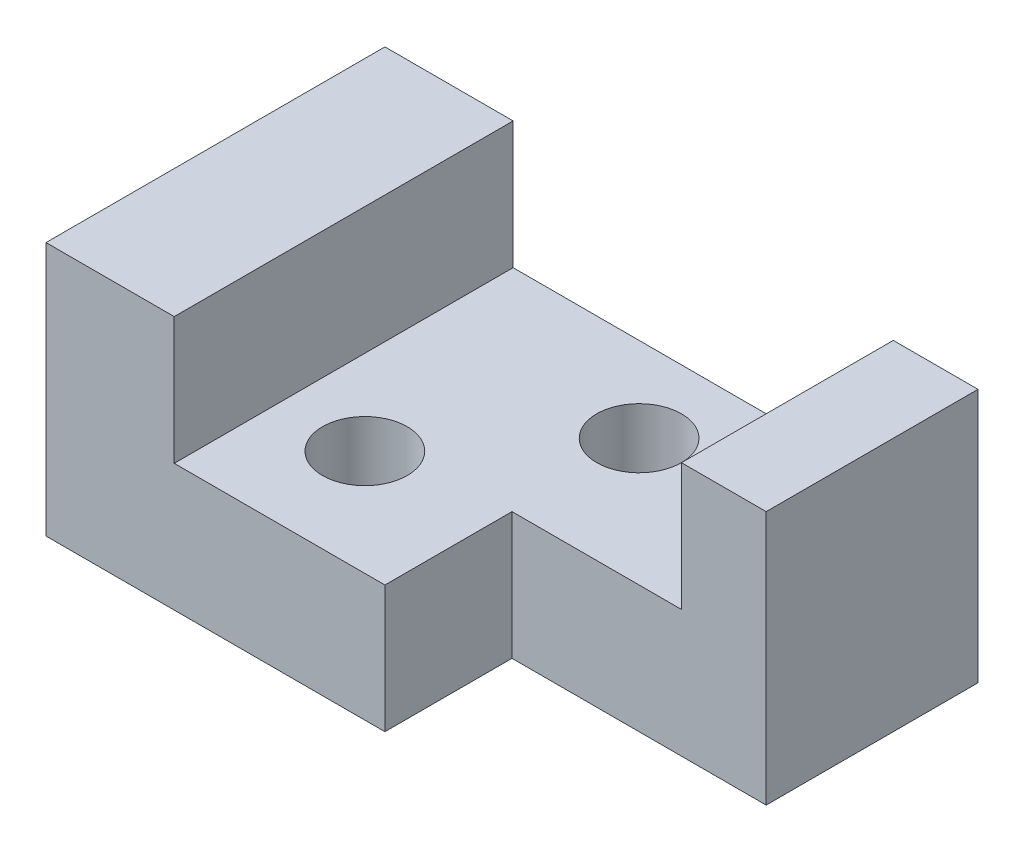
ISO-10303-21;
HEADER;
FILE_DESCRIPTION(('STEP AP214'),'2;1');
FILE_NAME('part.step','',(''),(''),'','','');
FILE_SCHEMA(('AUTOMOTIVE_DESIGN { 1 0 10303 214 1 1 1 1 }'));
ENDSEC;
DATA;
#1=APPLICATION_CONTEXT('core data for automotive mechanical design processes');
#2=APPLICATION_PROTOCOL_DEFINITION('international standard','automotive_design',2000,#1);
#3=PRODUCT_CONTEXT('',#1,'mechanical');
#4=PRODUCT('Part','Part','',(#3));
#5=PRODUCT_RELATED_PRODUCT_CATEGORY('part','',(#4));
#6=PRODUCT_DEFINITION_FORMATION('','',#4);
#7=PRODUCT_DEFINITION_CONTEXT('part definition',#1,'design');
#8=PRODUCT_DEFINITION('design','',#6,#7);
#9=PRODUCT_DEFINITION_SHAPE('','',#8);
#10=(LENGTH_UNIT() NAMED_UNIT(*) SI_UNIT(.MILLI.,.METRE.));
#11=(NAMED_UNIT(*) PLANE_ANGLE_UNIT() SI_UNIT($,.RADIAN.));
#12=(NAMED_UNIT(*) SI_UNIT($,.STERADIAN.) SOLID_ANGLE_UNIT());
#13=UNCERTAINTY_MEASURE_WITH_UNIT(LENGTH_MEASURE(1.E-05),#10,'distance_accuracy_value','');
#14=(GEOMETRIC_REPRESENTATION_CONTEXT(3) GLOBAL_UNCERTAINTY_ASSIGNED_CONTEXT((#13)) GLOBAL_UNIT_ASSIGNED_CONTEXT((#10,
#11,#12)) REPRESENTATION_CONTEXT('',''));
#15=CARTESIAN_POINT('',(0.,0.,0.));
#16=DIRECTION('',(0.,0.,1.));
#17=DIRECTION('',(1.,0.,0.));
#18=AXIS2_PLACEMENT_3D('',#15,#16,#17);
#19=CARTESIAN_POINT('',(0.,30.,0.));
#20=DIRECTION('',(0.,-1.,0.));
#21=DIRECTION('',(0.,0.,-1.));
#22=AXIS2_PLACEMENT_3D('',#19,#20,#21);
#23=PLANE('',#22);
#24=DIRECTION('',(-1.,0.,0.));
#25=VECTOR('',#24,1.);
#26=CARTESIAN_POINT('',(0.,30.,-40.));
#27=LINE('',#26,#25);
#28=CARTESIAN_POINT('',(70.,30.,-40.));
#29=VERTEX_POINT('',#28);
#30=CARTESIAN_POINT('',(60.,30.,-40.));
#31=VERTEX_POINT('',#30);
#32=EDGE_CURVE('E216',#29,#31,#27,.T.);
#33=ORIENTED_EDGE('',*,*,#32,.T.);
#34=DIRECTION('',(0.,0.,-1.));
#35=VECTOR('',#34,1.);
#36=CARTESIAN_POINT('',(60.,30.,-40.));
#37=LINE('',#36,#35);
#38=CARTESIAN_POINT('',(60.,30.,-15.));
#39=VERTEX_POINT('',#38);
#40=EDGE_CURVE('E137',#39,#31,#37,.T.);
#41=ORIENTED_EDGE('',*,*,#40,.F.);
#42=DIRECTION('',(-1.,0.,0.));
#43=VECTOR('',#42,1.);
#44=CARTESIAN_POINT('',(40.,30.,-15.));
#45=LINE('',#44,#43);
#46=CARTESIAN_POINT('',(70.,30.,-15.));
#47=VERTEX_POINT('',#46);
#48=EDGE_CURVE('E183',#47,#39,#45,.T.);
#49=ORIENTED_EDGE('',*,*,#48,.F.);
#50=DIRECTION('',(0.,0.,-1.));
#51=VECTOR('',#50,1.);
#52=CARTESIAN_POINT('',(70.,30.,0.));
#53=LINE('',#52,#51);
#54=EDGE_CURVE('E212',#47,#29,#53,.T.);
#55=ORIENTED_EDGE('',*,*,#54,.T.);
#56=EDGE_LOOP('',(#33,#41,#49,#55));
#57=FACE_BOUND('',#56,.T.);
#58=ADVANCED_FACE('F39',(#57),#23,.F.);
#59=CARTESIAN_POINT('',(0.,30.,0.));
#60=DIRECTION('',(1.,0.,0.));
#61=DIRECTION('',(0.,0.,-1.));
#62=AXIS2_PLACEMENT_3D('',#59,#60,#61);
#63=PLANE('',#62);
#64=DIRECTION('',(0.,0.,1.));
#65=VECTOR('',#64,1.);
#66=CARTESIAN_POINT('',(0.,0.,0.));
#67=LINE('',#66,#65);
#68=CARTESIAN_POINT('',(0.,0.,-40.));
#69=VERTEX_POINT('',#68);
#70=CARTESIAN_POINT('',(0.,0.,0.));
#71=VERTEX_POINT('',#70);
#72=EDGE_CURVE('E197',#69,#71,#67,.T.);
#73=ORIENTED_EDGE('',*,*,#72,.T.);
#74=DIRECTION('',(0.,-1.,0.));
#75=VECTOR('',#74,1.);
#76=CARTESIAN_POINT('',(0.,30.,0.));
#77=LINE('',#76,#75);
#78=CARTESIAN_POINT('',(0.,30.,0.));
#79=VERTEX_POINT('',#78);
#80=EDGE_CURVE('E48',#79,#71,#77,.T.);
#81=ORIENTED_EDGE('',*,*,#80,.F.);
#82=DIRECTION('',(0.,0.,1.));
#83=VECTOR('',#82,1.);
#84=CARTESIAN_POINT('',(0.,30.,0.));
#85=LINE('',#84,#83);
#86=CARTESIAN_POINT('',(0.,30.,-40.));
#87=VERTEX_POINT('',#86);
#88=EDGE_CURVE('E204',#87,#79,#85,.T.);
#89=ORIENTED_EDGE('',*,*,#88,.F.);
#90=DIRECTION('',(0.,-1.,0.));
#91=VECTOR('',#90,1.);
#92=CARTESIAN_POINT('',(0.,30.,-40.));
#93=LINE('',#92,#91);
#94=EDGE_CURVE('E219',#87,#69,#93,.T.);
#95=ORIENTED_EDGE('',*,*,#94,.T.);
#96=EDGE_LOOP('',(#73,#81,#89,#95));
#97=FACE_BOUND('',#96,.T.);
#98=ADVANCED_FACE('F41',(#97),#63,.F.);
#99=CARTESIAN_POINT('',(0.,30.,0.));
#100=DIRECTION('',(0.,0.,-1.));
#101=DIRECTION('',(-1.,0.,0.));
#102=AXIS2_PLACEMENT_3D('',#99,#100,#101);
#103=PLANE('',#102);
#104=ORIENTED_EDGE('',*,*,#80,.T.);
#105=DIRECTION('',(1.,0.,0.));
#106=VECTOR('',#105,1.);
#107=CARTESIAN_POINT('',(0.,0.,0.));
#108=LINE('',#107,#106);
#109=CARTESIAN_POINT('',(40.,0.,0.));
#110=VERTEX_POINT('',#109);
#111=EDGE_CURVE('E223',#71,#110,#108,.T.);
#112=ORIENTED_EDGE('',*,*,#111,.T.);
#113=DIRECTION('',(0.,1.,0.));
#114=VECTOR('',#113,1.);
#115=CARTESIAN_POINT('',(40.,0.,0.));
#116=LINE('',#115,#114);
#117=CARTESIAN_POINT('',(40.,15.,0.));
#118=VERTEX_POINT('',#117);
#119=EDGE_CURVE('E190',#110,#118,#116,.T.);
#120=ORIENTED_EDGE('',*,*,#119,.T.);
#121=DIRECTION('',(-1.,0.,0.));
#122=VECTOR('',#121,1.);
#123=CARTESIAN_POINT('',(56.8625684816038,15.,0.));
#124=LINE('',#123,#122);
#125=CARTESIAN_POINT('',(15.1339475960128,15.,0.));
#126=VERTEX_POINT('',#125);
#127=EDGE_CURVE('E129',#118,#126,#124,.T.);
#128=ORIENTED_EDGE('',*,*,#127,.T.);
#129=DIRECTION('',(0.,1.,0.));
#130=VECTOR('',#129,1.);
#131=CARTESIAN_POINT('',(15.1339475960128,15.,0.));
#132=LINE('',#131,#130);
#133=CARTESIAN_POINT('',(15.1339475960128,30.,0.));
#134=VERTEX_POINT('',#133);
#135=EDGE_CURVE('E169',#126,#134,#132,.T.);
#136=ORIENTED_EDGE('',*,*,#135,.T.);
#137=DIRECTION('',(1.,0.,0.));
#138=VECTOR('',#137,1.);
#139=CARTESIAN_POINT('',(0.,30.,0.));
#140=LINE('',#139,#138);
#141=EDGE_CURVE('E208',#79,#134,#140,.T.);
#142=ORIENTED_EDGE('',*,*,#141,.F.);
#143=EDGE_LOOP('',(#104,#112,#120,#128,#136,#142));
#144=FACE_BOUND('',#143,.T.);
#145=ADVANCED_FACE('F242',(#144),#103,.F.);
#146=CARTESIAN_POINT('',(70.,30.,0.));
#147=DIRECTION('',(-1.,0.,0.));
#148=DIRECTION('',(0.,0.,1.));
#149=AXIS2_PLACEMENT_3D('',#146,#147,#148);
#150=PLANE('',#149);
#151=ORIENTED_EDGE('',*,*,#54,.F.);
#152=DIRECTION('',(0.,1.,0.));
#153=VECTOR('',#152,1.);
#154=CARTESIAN_POINT('',(70.,0.,-15.));
#155=LINE('',#154,#153);
#156=CARTESIAN_POINT('',(70.,0.,-15.));
#157=VERTEX_POINT('',#156);
#158=EDGE_CURVE('E198',#157,#47,#155,.T.);
#159=ORIENTED_EDGE('',*,*,#158,.F.);
#160=DIRECTION('',(0.,0.,-1.));
#161=VECTOR('',#160,1.);
#162=CARTESIAN_POINT('',(70.,0.,0.));
#163=LINE('',#162,#161);
#164=CARTESIAN_POINT('',(70.,0.,-40.));
#165=VERTEX_POINT('',#164);
#166=EDGE_CURVE('E227',#157,#165,#163,.T.);
#167=ORIENTED_EDGE('',*,*,#166,.T.);
#168=DIRECTION('',(0.,-1.,0.));
#169=VECTOR('',#168,1.);
#170=CARTESIAN_POINT('',(70.,30.,-40.));
#171=LINE('',#170,#169);
#172=EDGE_CURVE('E235',#29,#165,#171,.T.);
#173=ORIENTED_EDGE('',*,*,#172,.F.);
#174=EDGE_LOOP('',(#151,#159,#167,#173));
#175=FACE_BOUND('',#174,.T.);
#176=ADVANCED_FACE('F255',(#175),#150,.F.);
#177=CARTESIAN_POINT('',(0.,30.,-40.));
#178=DIRECTION('',(0.,0.,1.));
#179=DIRECTION('',(1.,0.,0.));
#180=AXIS2_PLACEMENT_3D('',#177,#178,#179);
#181=PLANE('',#180);
#182=DIRECTION('',(-1.,0.,0.));
#183=VECTOR('',#182,1.);
#184=CARTESIAN_POINT('',(56.8625684816038,15.,-40.));
#185=LINE('',#184,#183);
#186=CARTESIAN_POINT('',(60.,15.,-40.));
#187=VERTEX_POINT('',#186);
#188=CARTESIAN_POINT('',(15.1339475960128,15.,-40.));
#189=VERTEX_POINT('',#188);
#190=EDGE_CURVE('E117',#187,#189,#185,.T.);
#191=ORIENTED_EDGE('',*,*,#190,.F.);
#192=DIRECTION('',(0.,1.,0.));
#193=VECTOR('',#192,1.);
#194=CARTESIAN_POINT('',(60.,15.,-40.));
#195=LINE('',#194,#193);
#196=EDGE_CURVE('E121',#187,#31,#195,.T.);
#197=ORIENTED_EDGE('',*,*,#196,.T.);
#198=ORIENTED_EDGE('',*,*,#32,.F.);
#199=ORIENTED_EDGE('',*,*,#172,.T.);
#200=DIRECTION('',(-1.,0.,0.));
#201=VECTOR('',#200,1.);
#202=CARTESIAN_POINT('',(0.,0.,-40.));
#203=LINE('',#202,#201);
#204=EDGE_CURVE('E209',#165,#69,#203,.T.);
#205=ORIENTED_EDGE('',*,*,#204,.T.);
#206=ORIENTED_EDGE('',*,*,#94,.F.);
#207=CARTESIAN_POINT('',(15.1339475960128,30.,-40.));
#208=VERTEX_POINT('',#207);
#209=EDGE_CURVE('E215',#208,#87,#27,.T.);
#210=ORIENTED_EDGE('',*,*,#209,.F.);
#211=DIRECTION('',(0.,1.,0.));
#212=VECTOR('',#211,1.);
#213=CARTESIAN_POINT('',(15.1339475960128,15.,-40.));
#214=LINE('',#213,#212);
#215=EDGE_CURVE('E124',#189,#208,#214,.T.);
#216=ORIENTED_EDGE('',*,*,#215,.F.);
#217=EDGE_LOOP('',(#191,#197,#198,#199,#205,#206,#210,#216));
#218=FACE_BOUND('',#217,.T.);
#219=ADVANCED_FACE('F119',(#218),#181,.F.);
#220=ORIENTED_EDGE('',*,*,#141,.T.);
#221=DIRECTION('',(0.,0.,-1.));
#222=VECTOR('',#221,1.);
#223=CARTESIAN_POINT('',(15.1339475960128,30.,0.));
#224=LINE('',#223,#222);
#225=EDGE_CURVE('E162',#134,#208,#224,.T.);
#226=ORIENTED_EDGE('',*,*,#225,.T.);
#227=ORIENTED_EDGE('',*,*,#209,.T.);
#228=ORIENTED_EDGE('',*,*,#88,.T.);
#229=EDGE_LOOP('',(#220,#226,#227,#228));
#230=FACE_BOUND('',#229,.T.);
#231=ADVANCED_FACE('F262',(#230),#23,.F.);
#232=CARTESIAN_POINT('',(0.,0.,0.));
#233=DIRECTION('',(0.,-1.,0.));
#234=DIRECTION('',(0.,0.,-1.));
#235=AXIS2_PLACEMENT_3D('',#232,#233,#234);
#236=PLANE('',#235);
#237=CARTESIAN_POINT('',(25.1339475960128,0.,-12.5));
#238=DIRECTION('',(0.,1.,0.));
#239=DIRECTION('',(0.,0.,1.));
#240=AXIS2_PLACEMENT_3D('',#237,#238,#239);
#241=CIRCLE('',#240,5.);
#242=CARTESIAN_POINT('',(25.1339475960128,0.,-7.5));
#243=VERTEX_POINT('',#242);
#244=EDGE_CURVE('E150',#243,#243,#241,.T.);
#245=ORIENTED_EDGE('',*,*,#244,.T.);
#246=EDGE_LOOP('',(#245));
#247=FACE_BOUND('',#246,.T.);
#248=CARTESIAN_POINT('',(40.,0.,-30.));
#249=DIRECTION('',(0.,1.,0.));
#250=DIRECTION('',(0.,0.,1.));
#251=AXIS2_PLACEMENT_3D('',#248,#249,#250);
#252=CIRCLE('',#251,5.);
#253=CARTESIAN_POINT('',(40.,0.,-25.));
#254=VERTEX_POINT('',#253);
#255=EDGE_CURVE('E158',#254,#254,#252,.T.);
#256=ORIENTED_EDGE('',*,*,#255,.T.);
#257=EDGE_LOOP('',(#256));
#258=FACE_BOUND('',#257,.T.);
#259=DIRECTION('',(0.,0.,1.));
#260=VECTOR('',#259,1.);
#261=CARTESIAN_POINT('',(40.,0.,-15.));
#262=LINE('',#261,#260);
#263=CARTESIAN_POINT('',(40.,0.,-15.));
#264=VERTEX_POINT('',#263);
#265=EDGE_CURVE('E62',#264,#110,#262,.T.);
#266=ORIENTED_EDGE('',*,*,#265,.T.);
#267=ORIENTED_EDGE('',*,*,#111,.F.);
#268=ORIENTED_EDGE('',*,*,#72,.F.);
#269=ORIENTED_EDGE('',*,*,#204,.F.);
#270=ORIENTED_EDGE('',*,*,#166,.F.);
#271=DIRECTION('',(-1.,0.,0.));
#272=VECTOR('',#271,1.);
#273=CARTESIAN_POINT('',(40.,0.,-15.));
#274=LINE('',#273,#272);
#275=EDGE_CURVE('E186',#157,#264,#274,.T.);
#276=ORIENTED_EDGE('',*,*,#275,.T.);
#277=EDGE_LOOP('',(#266,#267,#268,#269,#270,#276));
#278=FACE_BOUND('',#277,.T.);
#279=ADVANCED_FACE('F247',(#247,#258,#278),#236,.T.);
#280=CARTESIAN_POINT('',(40.,0.,-15.));
#281=DIRECTION('',(-1.,0.,0.));
#282=DIRECTION('',(0.,0.,1.));
#283=AXIS2_PLACEMENT_3D('',#280,#281,#282);
#284=PLANE('',#283);
#285=DIRECTION('',(0.,1.,0.));
#286=VECTOR('',#285,1.);
#287=CARTESIAN_POINT('',(40.,0.,-15.));
#288=LINE('',#287,#286);
#289=CARTESIAN_POINT('',(40.,15.,-15.));
#290=VERTEX_POINT('',#289);
#291=EDGE_CURVE('E194',#264,#290,#288,.T.);
#292=ORIENTED_EDGE('',*,*,#291,.T.);
#293=DIRECTION('',(0.,0.,1.));
#294=VECTOR('',#293,1.);
#295=CARTESIAN_POINT('',(40.,15.,-15.));
#296=LINE('',#295,#294);
#297=EDGE_CURVE('E55',#290,#118,#296,.T.);
#298=ORIENTED_EDGE('',*,*,#297,.T.);
#299=ORIENTED_EDGE('',*,*,#119,.F.);
#300=ORIENTED_EDGE('',*,*,#265,.F.);
#301=EDGE_LOOP('',(#292,#298,#299,#300));
#302=FACE_BOUND('',#301,.T.);
#303=ADVANCED_FACE('F274',(#302),#284,.F.);
#304=CARTESIAN_POINT('',(40.,0.,-15.));
#305=DIRECTION('',(0.,0.,-1.));
#306=DIRECTION('',(-1.,0.,0.));
#307=AXIS2_PLACEMENT_3D('',#304,#305,#306);
#308=PLANE('',#307);
#309=ORIENTED_EDGE('',*,*,#48,.T.);
#310=DIRECTION('',(0.,1.,0.));
#311=VECTOR('',#310,1.);
#312=CARTESIAN_POINT('',(60.,15.,-15.));
#313=LINE('',#312,#311);
#314=CARTESIAN_POINT('',(60.,15.,-15.));
#315=VERTEX_POINT('',#314);
#316=EDGE_CURVE('E139',#315,#39,#313,.T.);
#317=ORIENTED_EDGE('',*,*,#316,.F.);
#318=DIRECTION('',(-1.,0.,0.));
#319=VECTOR('',#318,1.);
#320=CARTESIAN_POINT('',(40.,15.,-15.));
#321=LINE('',#320,#319);
#322=EDGE_CURVE('E11',#315,#290,#321,.T.);
#323=ORIENTED_EDGE('',*,*,#322,.T.);
#324=ORIENTED_EDGE('',*,*,#291,.F.);
#325=ORIENTED_EDGE('',*,*,#275,.F.);
#326=ORIENTED_EDGE('',*,*,#158,.T.);
#327=EDGE_LOOP('',(#309,#317,#323,#324,#325,#326));
#328=FACE_BOUND('',#327,.T.);
#329=ADVANCED_FACE('F258',(#328),#308,.F.);
#330=CARTESIAN_POINT('',(56.8625684816038,15.,0.));
#331=DIRECTION('',(0.,-1.,0.));
#332=DIRECTION('',(0.,0.,-1.));
#333=AXIS2_PLACEMENT_3D('',#330,#331,#332);
#334=PLANE('',#333);
#335=CARTESIAN_POINT('',(25.1339475960128,15.,-12.5));
#336=DIRECTION('',(0.,1.,0.));
#337=DIRECTION('',(0.,0.,1.));
#338=AXIS2_PLACEMENT_3D('',#335,#336,#337);
#339=CIRCLE('',#338,5.);
#340=CARTESIAN_POINT('',(25.1339475960128,15.,-7.5));
#341=VERTEX_POINT('',#340);
#342=EDGE_CURVE('E148',#341,#341,#339,.T.);
#343=ORIENTED_EDGE('',*,*,#342,.F.);
#344=EDGE_LOOP('',(#343));
#345=FACE_BOUND('',#344,.T.);
#346=CARTESIAN_POINT('',(40.,15.,-30.));
#347=DIRECTION('',(0.,1.,0.));
#348=DIRECTION('',(0.,0.,1.));
#349=AXIS2_PLACEMENT_3D('',#346,#347,#348);
#350=CIRCLE('',#349,5.);
#351=CARTESIAN_POINT('',(40.,15.,-25.));
#352=VERTEX_POINT('',#351);
#353=EDGE_CURVE('E154',#352,#352,#350,.T.);
#354=ORIENTED_EDGE('',*,*,#353,.F.);
#355=EDGE_LOOP('',(#354));
#356=FACE_BOUND('',#355,.T.);
#357=ORIENTED_EDGE('',*,*,#190,.T.);
#358=DIRECTION('',(0.,0.,-1.));
#359=VECTOR('',#358,1.);
#360=CARTESIAN_POINT('',(15.1339475960128,15.,0.));
#361=LINE('',#360,#359);
#362=EDGE_CURVE('E166',#126,#189,#361,.T.);
#363=ORIENTED_EDGE('',*,*,#362,.F.);
#364=ORIENTED_EDGE('',*,*,#127,.F.);
#365=ORIENTED_EDGE('',*,*,#297,.F.);
#366=ORIENTED_EDGE('',*,*,#322,.F.);
#367=DIRECTION('',(0.,0.,-1.));
#368=VECTOR('',#367,1.);
#369=CARTESIAN_POINT('',(60.,15.,-40.));
#370=LINE('',#369,#368);
#371=EDGE_CURVE('E134',#315,#187,#370,.T.);
#372=ORIENTED_EDGE('',*,*,#371,.T.);
#373=EDGE_LOOP('',(#357,#363,#364,#365,#366,#372));
#374=FACE_BOUND('',#373,.T.);
#375=ADVANCED_FACE('F141',(#345,#356,#374),#334,.F.);
#376=CARTESIAN_POINT('',(15.1339475960128,15.,0.));
#377=DIRECTION('',(1.,0.,0.));
#378=DIRECTION('',(0.,0.,-1.));
#379=AXIS2_PLACEMENT_3D('',#376,#377,#378);
#380=PLANE('',#379);
#381=ORIENTED_EDGE('',*,*,#225,.F.);
#382=ORIENTED_EDGE('',*,*,#135,.F.);
#383=ORIENTED_EDGE('',*,*,#362,.T.);
#384=ORIENTED_EDGE('',*,*,#215,.T.);
#385=EDGE_LOOP('',(#381,#382,#383,#384));
#386=FACE_BOUND('',#385,.T.);
#387=ADVANCED_FACE('F279',(#386),#380,.T.);
#388=CARTESIAN_POINT('',(40.,0.,-30.));
#389=DIRECTION('',(0.,1.,0.));
#390=DIRECTION('',(0.,0.,1.));
#391=AXIS2_PLACEMENT_3D('',#388,#389,#390);
#392=CYLINDRICAL_SURFACE('',#391,5.);
#393=ORIENTED_EDGE('',*,*,#255,.F.);
#394=EDGE_LOOP('',(#393));
#395=FACE_BOUND('',#394,.T.);
#396=ORIENTED_EDGE('',*,*,#353,.T.);
#397=EDGE_LOOP('',(#396));
#398=FACE_BOUND('',#397,.T.);
#399=ADVANCED_FACE('F291',(#395,#398),#392,.F.);
#400=CARTESIAN_POINT('',(25.1339475960128,0.,-12.5));
#401=DIRECTION('',(0.,1.,0.));
#402=DIRECTION('',(0.,0.,1.));
#403=AXIS2_PLACEMENT_3D('',#400,#401,#402);
#404=CYLINDRICAL_SURFACE('',#403,5.);
#405=ORIENTED_EDGE('',*,*,#244,.F.);
#406=EDGE_LOOP('',(#405));
#407=FACE_BOUND('',#406,.T.);
#408=ORIENTED_EDGE('',*,*,#342,.T.);
#409=EDGE_LOOP('',(#408));
#410=FACE_BOUND('',#409,.T.);
#411=ADVANCED_FACE('F294',(#407,#410),#404,.F.);
#412=CARTESIAN_POINT('',(60.,15.,-40.));
#413=DIRECTION('',(1.,0.,0.));
#414=DIRECTION('',(0.,0.,-1.));
#415=AXIS2_PLACEMENT_3D('',#412,#413,#414);
#416=PLANE('',#415);
#417=ORIENTED_EDGE('',*,*,#40,.T.);
#418=ORIENTED_EDGE('',*,*,#196,.F.);
#419=ORIENTED_EDGE('',*,*,#371,.F.);
#420=ORIENTED_EDGE('',*,*,#316,.T.);
#421=EDGE_LOOP('',(#417,#418,#419,#420));
#422=FACE_BOUND('',#421,.T.);
#423=ADVANCED_FACE('F133',(#422),#416,.F.);
#424=CLOSED_SHELL('',(#58,#98,#145,#176,#219,#231,#279,#303,#329,#375,#387,#399,#411,#423));
#425=MANIFOLD_SOLID_BREP('B2',#424);
#426=ADVANCED_BREP_SHAPE_REPRESENTATION('',(#18,#425),#14);
#427=SHAPE_DEFINITION_REPRESENTATION(#9,#426);
ENDSEC;
END-ISO-10303-21;
